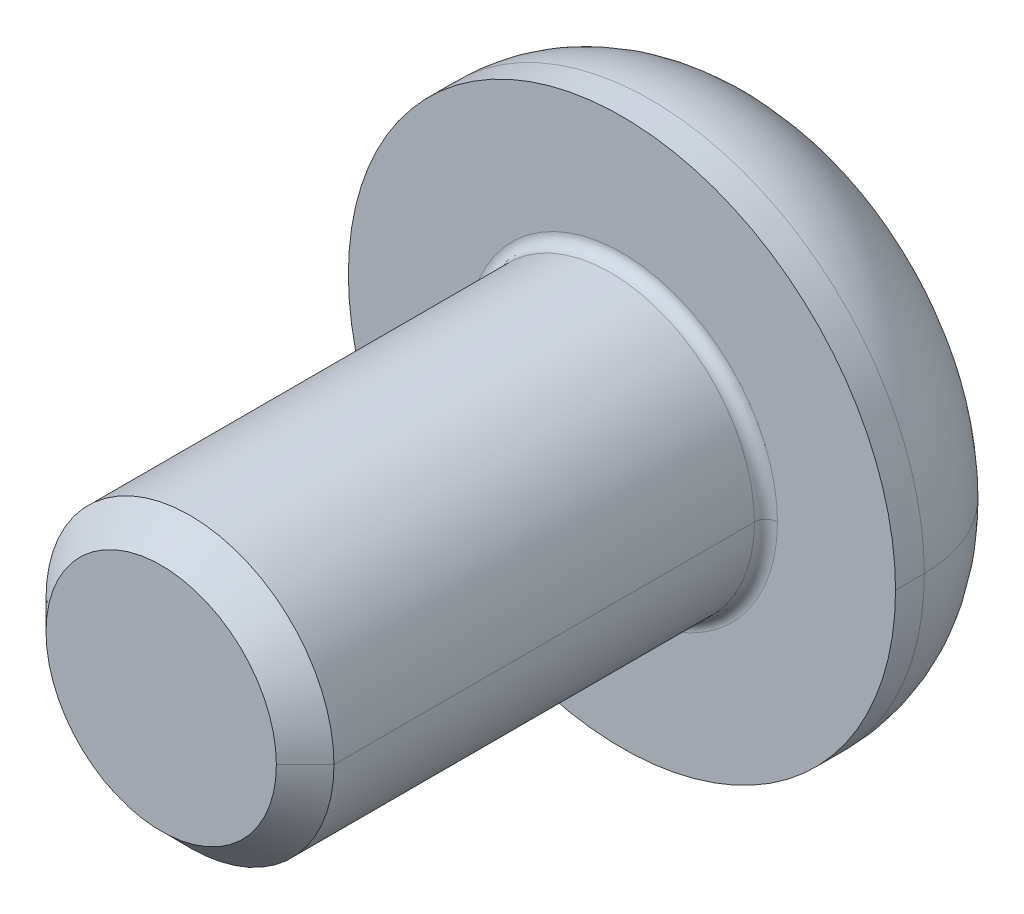
ISO-10303-21;
HEADER;
FILE_DESCRIPTION(('STEP AP214'),'2;1');
FILE_NAME('part.step','',(''),(''),'','','');
FILE_SCHEMA(('AUTOMOTIVE_DESIGN { 1 0 10303 214 1 1 1 1 }'));
ENDSEC;
DATA;
#1=APPLICATION_CONTEXT('core data for automotive mechanical design processes');
#2=APPLICATION_PROTOCOL_DEFINITION('international standard','automotive_design',2000,#1);
#3=PRODUCT_CONTEXT('',#1,'mechanical');
#4=PRODUCT('Part','Part','',(#3));
#5=PRODUCT_RELATED_PRODUCT_CATEGORY('part','',(#4));
#6=PRODUCT_DEFINITION_FORMATION('','',#4);
#7=PRODUCT_DEFINITION_CONTEXT('part definition',#1,'design');
#8=PRODUCT_DEFINITION('design','',#6,#7);
#9=PRODUCT_DEFINITION_SHAPE('','',#8);
#10=(LENGTH_UNIT() NAMED_UNIT(*) SI_UNIT(.MILLI.,.METRE.));
#11=(NAMED_UNIT(*) PLANE_ANGLE_UNIT() SI_UNIT($,.RADIAN.));
#12=(NAMED_UNIT(*) SI_UNIT($,.STERADIAN.) SOLID_ANGLE_UNIT());
#13=UNCERTAINTY_MEASURE_WITH_UNIT(LENGTH_MEASURE(1.E-05),#10,'distance_accuracy_value','');
#14=(GEOMETRIC_REPRESENTATION_CONTEXT(3) GLOBAL_UNCERTAINTY_ASSIGNED_CONTEXT((#13)) GLOBAL_UNIT_ASSIGNED_CONTEXT((#10,
#11,#12)) REPRESENTATION_CONTEXT('',''));
#15=CARTESIAN_POINT('',(0.,0.,0.));
#16=DIRECTION('',(0.,0.,1.));
#17=DIRECTION('',(1.,0.,0.));
#18=AXIS2_PLACEMENT_3D('',#15,#16,#17);
#19=CARTESIAN_POINT('',(0.,0.,0.2));
#20=DIRECTION('',(0.,0.,-1.));
#21=DIRECTION('',(-1.,0.,0.));
#22=AXIS2_PLACEMENT_3D('',#19,#20,#21);
#23=TOROIDAL_SURFACE('',#22,2.7,0.2);
#24=CARTESIAN_POINT('',(2.7,0.,0.2));
#25=DIRECTION('',(0.,1.,0.));
#26=DIRECTION('',(-1.,0.,0.));
#27=AXIS2_PLACEMENT_3D('',#24,#25,#26);
#28=CIRCLE('',#27,0.2);
#29=CARTESIAN_POINT('',(2.7,0.,0.));
#30=VERTEX_POINT('',#29);
#31=CARTESIAN_POINT('',(2.5,0.,0.2));
#32=VERTEX_POINT('',#31);
#33=EDGE_CURVE('E231',#30,#32,#28,.T.);
#34=ORIENTED_EDGE('',*,*,#33,.F.);
#35=CARTESIAN_POINT('',(0.,0.,0.));
#36=DIRECTION('',(0.,0.,-1.));
#37=DIRECTION('',(-1.,0.,0.));
#38=AXIS2_PLACEMENT_3D('',#35,#36,#37);
#39=CIRCLE('',#38,2.7);
#40=CARTESIAN_POINT('',(-2.7,0.,0.));
#41=VERTEX_POINT('',#40);
#42=EDGE_CURVE('E191',#41,#30,#39,.T.);
#43=ORIENTED_EDGE('',*,*,#42,.F.);
#44=CARTESIAN_POINT('',(-2.7,0.,0.2));
#45=DIRECTION('',(0.,-1.,0.));
#46=DIRECTION('',(0.,0.,-1.));
#47=AXIS2_PLACEMENT_3D('',#44,#45,#46);
#48=CIRCLE('',#47,0.2);
#49=CARTESIAN_POINT('',(-2.5,0.,0.2));
#50=VERTEX_POINT('',#49);
#51=EDGE_CURVE('E260',#41,#50,#48,.T.);
#52=ORIENTED_EDGE('',*,*,#51,.T.);
#53=CARTESIAN_POINT('',(0.,0.,0.2));
#54=DIRECTION('',(0.,0.,1.));
#55=DIRECTION('',(-1.,0.,0.));
#56=AXIS2_PLACEMENT_3D('',#53,#54,#55);
#57=CIRCLE('',#56,2.5);
#58=EDGE_CURVE('E296',#32,#50,#57,.T.);
#59=ORIENTED_EDGE('',*,*,#58,.F.);
#60=EDGE_LOOP('',(#34,#43,#52,#59));
#61=FACE_BOUND('',#60,.T.);
#62=ADVANCED_FACE('F18',(#61),#23,.F.);
#63=CARTESIAN_POINT('',(0.,0.,8.));
#64=DIRECTION('',(0.,0.,-1.));
#65=DIRECTION('',(-1.,0.,0.));
#66=AXIS2_PLACEMENT_3D('',#63,#64,#65);
#67=CONICAL_SURFACE('',#66,2.,0.785398163397446);
#68=DIRECTION('',(0.707106781186546,0.,-0.707106781186549));
#69=VECTOR('',#68,1.);
#70=CARTESIAN_POINT('',(2.,0.,8.));
#71=LINE('',#70,#69);
#72=CARTESIAN_POINT('',(2.,0.,8.));
#73=VERTEX_POINT('',#72);
#74=CARTESIAN_POINT('',(2.5,0.,7.5));
#75=VERTEX_POINT('',#74);
#76=EDGE_CURVE('E226',#73,#75,#71,.T.);
#77=ORIENTED_EDGE('',*,*,#76,.F.);
#78=CARTESIAN_POINT('',(0.,0.,8.));
#79=DIRECTION('',(0.,0.,1.));
#80=DIRECTION('',(1.,0.,0.));
#81=AXIS2_PLACEMENT_3D('',#78,#79,#80);
#82=CIRCLE('',#81,2.);
#83=CARTESIAN_POINT('',(-2.,0.,8.));
#84=VERTEX_POINT('',#83);
#85=EDGE_CURVE('E241',#84,#73,#82,.T.);
#86=ORIENTED_EDGE('',*,*,#85,.F.);
#87=DIRECTION('',(-0.707106781186546,0.,-0.707106781186549));
#88=VECTOR('',#87,1.);
#89=CARTESIAN_POINT('',(-2.,0.,8.));
#90=LINE('',#89,#88);
#91=CARTESIAN_POINT('',(-2.5,0.,7.5));
#92=VERTEX_POINT('',#91);
#93=EDGE_CURVE('E246',#84,#92,#90,.T.);
#94=ORIENTED_EDGE('',*,*,#93,.T.);
#95=CARTESIAN_POINT('',(0.,0.,7.5));
#96=DIRECTION('',(0.,0.,-1.));
#97=DIRECTION('',(1.,0.,0.));
#98=AXIS2_PLACEMENT_3D('',#95,#96,#97);
#99=CIRCLE('',#98,2.5);
#100=EDGE_CURVE('E303',#75,#92,#99,.T.);
#101=ORIENTED_EDGE('',*,*,#100,.F.);
#102=EDGE_LOOP('',(#77,#86,#94,#101));
#103=FACE_BOUND('',#102,.T.);
#104=ADVANCED_FACE('F340',(#103),#67,.T.);
#105=CARTESIAN_POINT('',(0.,0.,-0.5));
#106=DIRECTION('',(0.,0.,-1.));
#107=DIRECTION('',(-1.,0.,0.));
#108=AXIS2_PLACEMENT_3D('',#105,#106,#107);
#109=TOROIDAL_SURFACE('',#108,2.5,2.25);
#110=CARTESIAN_POINT('',(2.5,0.,-0.5));
#111=DIRECTION('',(0.,1.,0.));
#112=DIRECTION('',(-1.,0.,0.));
#113=AXIS2_PLACEMENT_3D('',#110,#111,#112);
#114=CIRCLE('',#113,2.25);
#115=CARTESIAN_POINT('',(4.75,0.,-0.5));
#116=VERTEX_POINT('',#115);
#117=CARTESIAN_POINT('',(2.5,0.,-2.75));
#118=VERTEX_POINT('',#117);
#119=EDGE_CURVE('E237',#116,#118,#114,.T.);
#120=ORIENTED_EDGE('',*,*,#119,.F.);
#121=CARTESIAN_POINT('',(0.,0.,-0.5));
#122=DIRECTION('',(0.,0.,1.));
#123=DIRECTION('',(-1.,0.,0.));
#124=AXIS2_PLACEMENT_3D('',#121,#122,#123);
#125=CIRCLE('',#124,4.75);
#126=CARTESIAN_POINT('',(-4.75,0.,-0.5));
#127=VERTEX_POINT('',#126);
#128=EDGE_CURVE('E238',#127,#116,#125,.T.);
#129=ORIENTED_EDGE('',*,*,#128,.F.);
#130=CARTESIAN_POINT('',(-2.5,0.,-0.5));
#131=DIRECTION('',(0.,-1.,0.));
#132=DIRECTION('',(0.,0.,-1.));
#133=AXIS2_PLACEMENT_3D('',#130,#131,#132);
#134=CIRCLE('',#133,2.25);
#135=CARTESIAN_POINT('',(-2.5,0.,-2.75));
#136=VERTEX_POINT('',#135);
#137=EDGE_CURVE('E236',#127,#136,#134,.T.);
#138=ORIENTED_EDGE('',*,*,#137,.T.);
#139=CARTESIAN_POINT('',(0.,0.,-2.75));
#140=DIRECTION('',(0.,0.,-1.));
#141=DIRECTION('',(-1.,0.,0.));
#142=AXIS2_PLACEMENT_3D('',#139,#140,#141);
#143=CIRCLE('',#142,2.5);
#144=EDGE_CURVE('E176',#118,#136,#143,.T.);
#145=ORIENTED_EDGE('',*,*,#144,.F.);
#146=EDGE_LOOP('',(#120,#129,#138,#145));
#147=FACE_BOUND('',#146,.T.);
#148=ADVANCED_FACE('F326',(#147),#109,.T.);
#149=CARTESIAN_POINT('',(0.,0.,-1.19));
#150=DIRECTION('',(0.,0.,-1.));
#151=DIRECTION('',(0.,-1.,0.));
#152=AXIS2_PLACEMENT_3D('',#149,#150,#151);
#153=PLANE('',#152);
#154=DIRECTION('',(-1.,0.,0.));
#155=VECTOR('',#154,1.);
#156=CARTESIAN_POINT('',(0.866025403784439,-1.5,-1.19));
#157=LINE('',#156,#155);
#158=CARTESIAN_POINT('',(0.866025403784439,-1.5,-1.19));
#159=VERTEX_POINT('',#158);
#160=CARTESIAN_POINT('',(-0.866025403784439,-1.5,-1.19));
#161=VERTEX_POINT('',#160);
#162=EDGE_CURVE('E152',#159,#161,#157,.T.);
#163=ORIENTED_EDGE('',*,*,#162,.T.);
#164=DIRECTION('',(-0.5,0.866025403784439,0.));
#165=VECTOR('',#164,1.);
#166=CARTESIAN_POINT('',(-0.866025403784439,-1.5,-1.19));
#167=LINE('',#166,#165);
#168=CARTESIAN_POINT('',(-1.73205080756888,0.,-1.19));
#169=VERTEX_POINT('',#168);
#170=EDGE_CURVE('E11',#161,#169,#167,.T.);
#171=ORIENTED_EDGE('',*,*,#170,.T.);
#172=DIRECTION('',(0.5,0.866025403784439,0.));
#173=VECTOR('',#172,1.);
#174=CARTESIAN_POINT('',(-1.73205080756888,0.,-1.19));
#175=LINE('',#174,#173);
#176=CARTESIAN_POINT('',(-0.86602540378444,1.5,-1.19));
#177=VERTEX_POINT('',#176);
#178=EDGE_CURVE('E45',#169,#177,#175,.T.);
#179=ORIENTED_EDGE('',*,*,#178,.T.);
#180=DIRECTION('',(1.,0.,0.));
#181=VECTOR('',#180,1.);
#182=CARTESIAN_POINT('',(-0.86602540378444,1.5,-1.19));
#183=LINE('',#182,#181);
#184=CARTESIAN_POINT('',(0.866025403784439,1.5,-1.19));
#185=VERTEX_POINT('',#184);
#186=EDGE_CURVE('E211',#177,#185,#183,.T.);
#187=ORIENTED_EDGE('',*,*,#186,.T.);
#188=DIRECTION('',(0.5,-0.866025403784439,0.));
#189=VECTOR('',#188,1.);
#190=CARTESIAN_POINT('',(0.866025403784439,1.5,-1.19));
#191=LINE('',#190,#189);
#192=CARTESIAN_POINT('',(1.73205080756888,0.,-1.19));
#193=VERTEX_POINT('',#192);
#194=EDGE_CURVE('E207',#185,#193,#191,.T.);
#195=ORIENTED_EDGE('',*,*,#194,.T.);
#196=DIRECTION('',(-0.5,-0.866025403784439,0.));
#197=VECTOR('',#196,1.);
#198=CARTESIAN_POINT('',(1.73205080756888,0.,-1.19));
#199=LINE('',#198,#197);
#200=EDGE_CURVE('E156',#193,#159,#199,.T.);
#201=ORIENTED_EDGE('',*,*,#200,.T.);
#202=EDGE_LOOP('',(#163,#171,#179,#187,#195,#201));
#203=FACE_BOUND('',#202,.T.);
#204=ADVANCED_FACE('F704',(#203),#153,.T.);
#205=CARTESIAN_POINT('',(-0.866025403784439,-1.5,-1.19));
#206=DIRECTION('',(-0.866025403784439,-0.5,0.));
#207=DIRECTION('',(-0.5,0.866025403784439,0.));
#208=AXIS2_PLACEMENT_3D('',#205,#206,#207);
#209=PLANE('',#208);
#210=DIRECTION('',(-0.5,0.866025403784439,0.));
#211=VECTOR('',#210,1.);
#212=CARTESIAN_POINT('',(-0.866025403784439,-1.5,-2.75));
#213=LINE('',#212,#211);
#214=CARTESIAN_POINT('',(-0.866025403784439,-1.5,-2.75));
#215=VERTEX_POINT('',#214);
#216=CARTESIAN_POINT('',(-1.73205080756888,0.,-2.75));
#217=VERTEX_POINT('',#216);
#218=EDGE_CURVE('E174',#215,#217,#213,.T.);
#219=ORIENTED_EDGE('',*,*,#218,.T.);
#220=DIRECTION('',(0.,0.,-1.));
#221=VECTOR('',#220,1.);
#222=CARTESIAN_POINT('',(-1.73205080756888,0.,-1.19));
#223=LINE('',#222,#221);
#224=EDGE_CURVE('E26',#169,#217,#223,.T.);
#225=ORIENTED_EDGE('',*,*,#224,.F.);
#226=ORIENTED_EDGE('',*,*,#170,.F.);
#227=DIRECTION('',(0.,0.,-1.));
#228=VECTOR('',#227,1.);
#229=CARTESIAN_POINT('',(-0.866025403784439,-1.5,-1.19));
#230=LINE('',#229,#228);
#231=EDGE_CURVE('E188',#161,#215,#230,.T.);
#232=ORIENTED_EDGE('',*,*,#231,.T.);
#233=EDGE_LOOP('',(#219,#225,#226,#232));
#234=FACE_BOUND('',#233,.T.);
#235=ADVANCED_FACE('F675',(#234),#209,.F.);
#236=CARTESIAN_POINT('',(-1.73205080756888,0.,-1.19));
#237=DIRECTION('',(-0.866025403784439,0.5,0.));
#238=DIRECTION('',(0.,0.,1.));
#239=AXIS2_PLACEMENT_3D('',#236,#237,#238);
#240=PLANE('',#239);
#241=DIRECTION('',(0.5,0.866025403784439,0.));
#242=VECTOR('',#241,1.);
#243=CARTESIAN_POINT('',(-1.73205080756888,0.,-2.75));
#244=LINE('',#243,#242);
#245=CARTESIAN_POINT('',(-0.86602540378444,1.5,-2.75));
#246=VERTEX_POINT('',#245);
#247=EDGE_CURVE('E197',#217,#246,#244,.T.);
#248=ORIENTED_EDGE('',*,*,#247,.T.);
#249=DIRECTION('',(0.,0.,-1.));
#250=VECTOR('',#249,1.);
#251=CARTESIAN_POINT('',(-0.86602540378444,1.5,-1.19));
#252=LINE('',#251,#250);
#253=EDGE_CURVE('E214',#177,#246,#252,.T.);
#254=ORIENTED_EDGE('',*,*,#253,.F.);
#255=ORIENTED_EDGE('',*,*,#178,.F.);
#256=ORIENTED_EDGE('',*,*,#224,.T.);
#257=EDGE_LOOP('',(#248,#254,#255,#256));
#258=FACE_BOUND('',#257,.T.);
#259=ADVANCED_FACE('F637',(#258),#240,.F.);
#260=CARTESIAN_POINT('',(-0.86602540378444,1.5,-1.19));
#261=DIRECTION('',(0.,1.,0.));
#262=DIRECTION('',(1.,0.,0.));
#263=AXIS2_PLACEMENT_3D('',#260,#261,#262);
#264=PLANE('',#263);
#265=DIRECTION('',(1.,0.,0.));
#266=VECTOR('',#265,1.);
#267=CARTESIAN_POINT('',(-0.86602540378444,1.5,-2.75));
#268=LINE('',#267,#266);
#269=CARTESIAN_POINT('',(0.866025403784439,1.5,-2.75));
#270=VERTEX_POINT('',#269);
#271=EDGE_CURVE('E196',#246,#270,#268,.T.);
#272=ORIENTED_EDGE('',*,*,#271,.T.);
#273=DIRECTION('',(0.,0.,-1.));
#274=VECTOR('',#273,1.);
#275=CARTESIAN_POINT('',(0.866025403784439,1.5,-1.19));
#276=LINE('',#275,#274);
#277=EDGE_CURVE('E210',#185,#270,#276,.T.);
#278=ORIENTED_EDGE('',*,*,#277,.F.);
#279=ORIENTED_EDGE('',*,*,#186,.F.);
#280=ORIENTED_EDGE('',*,*,#253,.T.);
#281=EDGE_LOOP('',(#272,#278,#279,#280));
#282=FACE_BOUND('',#281,.T.);
#283=ADVANCED_FACE('F632',(#282),#264,.F.);
#284=CARTESIAN_POINT('',(0.866025403784439,1.5,-1.19));
#285=DIRECTION('',(0.866025403784439,0.5,0.));
#286=DIRECTION('',(0.,0.,-1.));
#287=AXIS2_PLACEMENT_3D('',#284,#285,#286);
#288=PLANE('',#287);
#289=DIRECTION('',(0.5,-0.866025403784439,0.));
#290=VECTOR('',#289,1.);
#291=CARTESIAN_POINT('',(0.866025403784439,1.5,-2.75));
#292=LINE('',#291,#290);
#293=CARTESIAN_POINT('',(1.73205080756888,0.,-2.75));
#294=VERTEX_POINT('',#293);
#295=EDGE_CURVE('E167',#270,#294,#292,.T.);
#296=ORIENTED_EDGE('',*,*,#295,.T.);
#297=DIRECTION('',(0.,0.,-1.));
#298=VECTOR('',#297,1.);
#299=CARTESIAN_POINT('',(1.73205080756888,0.,-1.19));
#300=LINE('',#299,#298);
#301=EDGE_CURVE('E162',#193,#294,#300,.T.);
#302=ORIENTED_EDGE('',*,*,#301,.F.);
#303=ORIENTED_EDGE('',*,*,#194,.F.);
#304=ORIENTED_EDGE('',*,*,#277,.T.);
#305=EDGE_LOOP('',(#296,#302,#303,#304));
#306=FACE_BOUND('',#305,.T.);
#307=ADVANCED_FACE('F566',(#306),#288,.F.);
#308=CARTESIAN_POINT('',(1.73205080756888,0.,-1.19));
#309=DIRECTION('',(0.866025403784439,-0.5,0.));
#310=DIRECTION('',(0.,0.,-1.));
#311=AXIS2_PLACEMENT_3D('',#308,#309,#310);
#312=PLANE('',#311);
#313=DIRECTION('',(-0.5,-0.866025403784439,0.));
#314=VECTOR('',#313,1.);
#315=CARTESIAN_POINT('',(1.73205080756888,0.,-2.75));
#316=LINE('',#315,#314);
#317=CARTESIAN_POINT('',(0.866025403784439,-1.5,-2.75));
#318=VERTEX_POINT('',#317);
#319=EDGE_CURVE('E159',#294,#318,#316,.T.);
#320=ORIENTED_EDGE('',*,*,#319,.T.);
#321=DIRECTION('',(0.,0.,-1.));
#322=VECTOR('',#321,1.);
#323=CARTESIAN_POINT('',(0.866025403784439,-1.5,-1.19));
#324=LINE('',#323,#322);
#325=EDGE_CURVE('E146',#159,#318,#324,.T.);
#326=ORIENTED_EDGE('',*,*,#325,.F.);
#327=ORIENTED_EDGE('',*,*,#200,.F.);
#328=ORIENTED_EDGE('',*,*,#301,.T.);
#329=EDGE_LOOP('',(#320,#326,#327,#328));
#330=FACE_BOUND('',#329,.T.);
#331=ADVANCED_FACE('F160',(#330),#312,.F.);
#332=CARTESIAN_POINT('',(0.866025403784439,-1.5,-1.19));
#333=DIRECTION('',(0.,-1.,0.));
#334=DIRECTION('',(-1.,0.,0.));
#335=AXIS2_PLACEMENT_3D('',#332,#333,#334);
#336=PLANE('',#335);
#337=DIRECTION('',(-1.,0.,0.));
#338=VECTOR('',#337,1.);
#339=CARTESIAN_POINT('',(0.866025403784439,-1.5,-2.75));
#340=LINE('',#339,#338);
#341=EDGE_CURVE('E151',#318,#215,#340,.T.);
#342=ORIENTED_EDGE('',*,*,#341,.T.);
#343=ORIENTED_EDGE('',*,*,#231,.F.);
#344=ORIENTED_EDGE('',*,*,#162,.F.);
#345=ORIENTED_EDGE('',*,*,#325,.T.);
#346=EDGE_LOOP('',(#342,#343,#344,#345));
#347=FACE_BOUND('',#346,.T.);
#348=ADVANCED_FACE('F148',(#347),#336,.F.);
#349=CARTESIAN_POINT('',(0.,0.,0.));
#350=DIRECTION('',(0.,0.,-1.));
#351=DIRECTION('',(0.,-1.,0.));
#352=AXIS2_PLACEMENT_3D('',#349,#350,#351);
#353=PLANE('',#352);
#354=ORIENTED_EDGE('',*,*,#42,.T.);
#355=CARTESIAN_POINT('',(0.,0.,0.));
#356=DIRECTION('',(0.,0.,-1.));
#357=DIRECTION('',(-1.,0.,0.));
#358=AXIS2_PLACEMENT_3D('',#355,#356,#357);
#359=CIRCLE('',#358,2.7);
#360=EDGE_CURVE('E227',#30,#41,#359,.T.);
#361=ORIENTED_EDGE('',*,*,#360,.T.);
#362=EDGE_LOOP('',(#354,#361));
#363=FACE_BOUND('',#362,.T.);
#364=CARTESIAN_POINT('',(0.,0.,0.));
#365=DIRECTION('',(0.,0.,-1.));
#366=DIRECTION('',(-1.,0.,0.));
#367=AXIS2_PLACEMENT_3D('',#364,#365,#366);
#368=CIRCLE('',#367,4.75);
#369=CARTESIAN_POINT('',(4.75,0.,0.));
#370=VERTEX_POINT('',#369);
#371=CARTESIAN_POINT('',(-4.75,0.,0.));
#372=VERTEX_POINT('',#371);
#373=EDGE_CURVE('E182',#370,#372,#368,.T.);
#374=ORIENTED_EDGE('',*,*,#373,.F.);
#375=CARTESIAN_POINT('',(0.,0.,0.));
#376=DIRECTION('',(0.,0.,-1.));
#377=DIRECTION('',(-1.,0.,0.));
#378=AXIS2_PLACEMENT_3D('',#375,#376,#377);
#379=CIRCLE('',#378,4.75);
#380=EDGE_CURVE('E256',#372,#370,#379,.T.);
#381=ORIENTED_EDGE('',*,*,#380,.F.);
#382=EDGE_LOOP('',(#374,#381));
#383=FACE_BOUND('',#382,.T.);
#384=ADVANCED_FACE('F317',(#363,#383),#353,.F.);
#385=CARTESIAN_POINT('',(0.,0.,-2.75));
#386=DIRECTION('',(0.,0.,-1.));
#387=DIRECTION('',(0.,-1.,0.));
#388=AXIS2_PLACEMENT_3D('',#385,#386,#387);
#389=PLANE('',#388);
#390=ORIENTED_EDGE('',*,*,#341,.F.);
#391=ORIENTED_EDGE('',*,*,#319,.F.);
#392=ORIENTED_EDGE('',*,*,#295,.F.);
#393=ORIENTED_EDGE('',*,*,#271,.F.);
#394=ORIENTED_EDGE('',*,*,#247,.F.);
#395=ORIENTED_EDGE('',*,*,#218,.F.);
#396=EDGE_LOOP('',(#390,#391,#392,#393,#394,#395));
#397=FACE_BOUND('',#396,.T.);
#398=CARTESIAN_POINT('',(0.,0.,-2.75));
#399=DIRECTION('',(0.,0.,-1.));
#400=DIRECTION('',(-1.,0.,0.));
#401=AXIS2_PLACEMENT_3D('',#398,#399,#400);
#402=CIRCLE('',#401,2.5);
#403=EDGE_CURVE('E232',#136,#118,#402,.T.);
#404=ORIENTED_EDGE('',*,*,#403,.T.);
#405=ORIENTED_EDGE('',*,*,#144,.T.);
#406=EDGE_LOOP('',(#404,#405));
#407=FACE_BOUND('',#406,.T.);
#408=ADVANCED_FACE('F170',(#397,#407),#389,.T.);
#409=CARTESIAN_POINT('',(0.,0.,-2.75));
#410=DIRECTION('',(0.,0.,1.));
#411=DIRECTION('',(1.,0.,0.));
#412=AXIS2_PLACEMENT_3D('',#409,#410,#411);
#413=CYLINDRICAL_SURFACE('',#412,4.75);
#414=DIRECTION('',(0.,0.,1.));
#415=VECTOR('',#414,1.);
#416=CARTESIAN_POINT('',(-4.75,0.,-2.75));
#417=LINE('',#416,#415);
#418=EDGE_CURVE('E278',#127,#372,#417,.T.);
#419=ORIENTED_EDGE('',*,*,#418,.F.);
#420=ORIENTED_EDGE('',*,*,#128,.T.);
#421=DIRECTION('',(0.,0.,1.));
#422=VECTOR('',#421,1.);
#423=CARTESIAN_POINT('',(4.75,0.,-2.75));
#424=LINE('',#423,#422);
#425=EDGE_CURVE('E251',#116,#370,#424,.T.);
#426=ORIENTED_EDGE('',*,*,#425,.T.);
#427=ORIENTED_EDGE('',*,*,#373,.T.);
#428=EDGE_LOOP('',(#419,#420,#426,#427));
#429=FACE_BOUND('',#428,.T.);
#430=ADVANCED_FACE('F313',(#429),#413,.T.);
#431=CARTESIAN_POINT('',(0.,0.,8.));
#432=DIRECTION('',(0.,0.,1.));
#433=DIRECTION('',(1.,0.,0.));
#434=AXIS2_PLACEMENT_3D('',#431,#432,#433);
#435=PLANE('',#434);
#436=ORIENTED_EDGE('',*,*,#85,.T.);
#437=CARTESIAN_POINT('',(0.,0.,8.));
#438=DIRECTION('',(0.,0.,1.));
#439=DIRECTION('',(1.,0.,0.));
#440=AXIS2_PLACEMENT_3D('',#437,#438,#439);
#441=CIRCLE('',#440,2.);
#442=EDGE_CURVE('E268',#73,#84,#441,.T.);
#443=ORIENTED_EDGE('',*,*,#442,.T.);
#444=EDGE_LOOP('',(#436,#443));
#445=FACE_BOUND('',#444,.T.);
#446=ADVANCED_FACE('F334',(#445),#435,.T.);
#447=CARTESIAN_POINT('',(0.,0.,8.));
#448=DIRECTION('',(0.,0.,-1.));
#449=DIRECTION('',(-1.,0.,0.));
#450=AXIS2_PLACEMENT_3D('',#447,#448,#449);
#451=CYLINDRICAL_SURFACE('',#450,2.5);
#452=DIRECTION('',(0.,0.,-1.));
#453=VECTOR('',#452,1.);
#454=CARTESIAN_POINT('',(2.5,0.,8.));
#455=LINE('',#454,#453);
#456=EDGE_CURVE('E255',#75,#32,#455,.T.);
#457=ORIENTED_EDGE('',*,*,#456,.F.);
#458=ORIENTED_EDGE('',*,*,#100,.T.);
#459=DIRECTION('',(0.,0.,-1.));
#460=VECTOR('',#459,1.);
#461=CARTESIAN_POINT('',(-2.5,0.,8.));
#462=LINE('',#461,#460);
#463=EDGE_CURVE('E300',#92,#50,#462,.T.);
#464=ORIENTED_EDGE('',*,*,#463,.T.);
#465=CARTESIAN_POINT('',(0.,0.,0.2));
#466=DIRECTION('',(0.,0.,1.));
#467=DIRECTION('',(-1.,0.,0.));
#468=AXIS2_PLACEMENT_3D('',#465,#466,#467);
#469=CIRCLE('',#468,2.5);
#470=EDGE_CURVE('E250',#50,#32,#469,.T.);
#471=ORIENTED_EDGE('',*,*,#470,.T.);
#472=EDGE_LOOP('',(#457,#458,#464,#471));
#473=FACE_BOUND('',#472,.T.);
#474=ADVANCED_FACE('F354',(#473),#451,.T.);
#475=CARTESIAN_POINT('',(0.,0.,8.));
#476=DIRECTION('',(0.,0.,-1.));
#477=DIRECTION('',(-1.,0.,0.));
#478=AXIS2_PLACEMENT_3D('',#475,#476,#477);
#479=CYLINDRICAL_SURFACE('',#478,2.5);
#480=CARTESIAN_POINT('',(0.,0.,7.5));
#481=DIRECTION('',(0.,0.,-1.));
#482=DIRECTION('',(1.,0.,0.));
#483=AXIS2_PLACEMENT_3D('',#480,#481,#482);
#484=CIRCLE('',#483,2.5);
#485=EDGE_CURVE('E261',#92,#75,#484,.T.);
#486=ORIENTED_EDGE('',*,*,#485,.T.);
#487=ORIENTED_EDGE('',*,*,#456,.T.);
#488=ORIENTED_EDGE('',*,*,#58,.T.);
#489=ORIENTED_EDGE('',*,*,#463,.F.);
#490=EDGE_LOOP('',(#486,#487,#488,#489));
#491=FACE_BOUND('',#490,.T.);
#492=ADVANCED_FACE('F357',(#491),#479,.T.);
#493=CARTESIAN_POINT('',(0.,0.,-2.75));
#494=DIRECTION('',(0.,0.,1.));
#495=DIRECTION('',(1.,0.,0.));
#496=AXIS2_PLACEMENT_3D('',#493,#494,#495);
#497=CYLINDRICAL_SURFACE('',#496,4.75);
#498=CARTESIAN_POINT('',(0.,0.,-0.5));
#499=DIRECTION('',(0.,0.,1.));
#500=DIRECTION('',(-1.,0.,0.));
#501=AXIS2_PLACEMENT_3D('',#498,#499,#500);
#502=CIRCLE('',#501,4.75);
#503=EDGE_CURVE('E242',#116,#127,#502,.T.);
#504=ORIENTED_EDGE('',*,*,#503,.T.);
#505=ORIENTED_EDGE('',*,*,#418,.T.);
#506=ORIENTED_EDGE('',*,*,#380,.T.);
#507=ORIENTED_EDGE('',*,*,#425,.F.);
#508=EDGE_LOOP('',(#504,#505,#506,#507));
#509=FACE_BOUND('',#508,.T.);
#510=ADVANCED_FACE('F319',(#509),#497,.T.);
#511=CARTESIAN_POINT('',(0.,0.,-0.5));
#512=DIRECTION('',(0.,0.,-1.));
#513=DIRECTION('',(-1.,0.,0.));
#514=AXIS2_PLACEMENT_3D('',#511,#512,#513);
#515=TOROIDAL_SURFACE('',#514,2.5,2.25);
#516=ORIENTED_EDGE('',*,*,#503,.F.);
#517=ORIENTED_EDGE('',*,*,#119,.T.);
#518=ORIENTED_EDGE('',*,*,#403,.F.);
#519=ORIENTED_EDGE('',*,*,#137,.F.);
#520=EDGE_LOOP('',(#516,#517,#518,#519));
#521=FACE_BOUND('',#520,.T.);
#522=ADVANCED_FACE('F323',(#521),#515,.T.);
#523=CARTESIAN_POINT('',(0.,0.,8.));
#524=DIRECTION('',(0.,0.,-1.));
#525=DIRECTION('',(-1.,0.,0.));
#526=AXIS2_PLACEMENT_3D('',#523,#524,#525);
#527=CONICAL_SURFACE('',#526,2.,0.785398163397446);
#528=ORIENTED_EDGE('',*,*,#442,.F.);
#529=ORIENTED_EDGE('',*,*,#76,.T.);
#530=ORIENTED_EDGE('',*,*,#485,.F.);
#531=ORIENTED_EDGE('',*,*,#93,.F.);
#532=EDGE_LOOP('',(#528,#529,#530,#531));
#533=FACE_BOUND('',#532,.T.);
#534=ADVANCED_FACE('F364',(#533),#527,.T.);
#535=CARTESIAN_POINT('',(0.,0.,0.2));
#536=DIRECTION('',(0.,0.,-1.));
#537=DIRECTION('',(-1.,0.,0.));
#538=AXIS2_PLACEMENT_3D('',#535,#536,#537);
#539=TOROIDAL_SURFACE('',#538,2.7,0.2);
#540=ORIENTED_EDGE('',*,*,#360,.F.);
#541=ORIENTED_EDGE('',*,*,#33,.T.);
#542=ORIENTED_EDGE('',*,*,#470,.F.);
#543=ORIENTED_EDGE('',*,*,#51,.F.);
#544=EDGE_LOOP('',(#540,#541,#542,#543));
#545=FACE_BOUND('',#544,.T.);
#546=ADVANCED_FACE('F351',(#545),#539,.F.);
#547=CLOSED_SHELL('',(#62,#104,#148,#204,#235,#259,#283,#307,#331,#348,#384,#408,#430,#446,#474,
#492,#510,#522,#534,#546));
#548=MANIFOLD_SOLID_BREP('B1',#547);
#549=ADVANCED_BREP_SHAPE_REPRESENTATION('',(#18,#548),#14);
#550=SHAPE_DEFINITION_REPRESENTATION(#9,#549);
ENDSEC;
END-ISO-10303-21;
